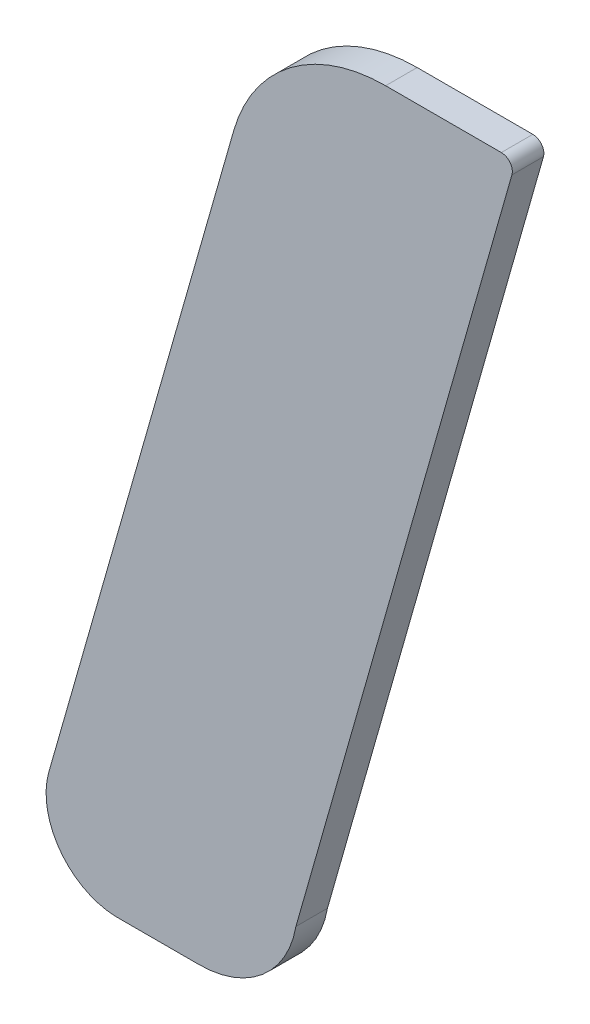
ISO-10303-21;
HEADER;
FILE_DESCRIPTION(('STEP AP214'),'2;1');
FILE_NAME('part.step','',(''),(''),'','','');
FILE_SCHEMA(('AUTOMOTIVE_DESIGN { 1 0 10303 214 1 1 1 1 }'));
ENDSEC;
DATA;
#1=APPLICATION_CONTEXT('core data for automotive mechanical design processes');
#2=APPLICATION_PROTOCOL_DEFINITION('international standard','automotive_design',2000,#1);
#3=PRODUCT_CONTEXT('',#1,'mechanical');
#4=PRODUCT('Part','Part','',(#3));
#5=PRODUCT_RELATED_PRODUCT_CATEGORY('part','',(#4));
#6=PRODUCT_DEFINITION_FORMATION('','',#4);
#7=PRODUCT_DEFINITION_CONTEXT('part definition',#1,'design');
#8=PRODUCT_DEFINITION('design','',#6,#7);
#9=PRODUCT_DEFINITION_SHAPE('','',#8);
#10=(LENGTH_UNIT() NAMED_UNIT(*) SI_UNIT(.MILLI.,.METRE.));
#11=(NAMED_UNIT(*) PLANE_ANGLE_UNIT() SI_UNIT($,.RADIAN.));
#12=(NAMED_UNIT(*) SI_UNIT($,.STERADIAN.) SOLID_ANGLE_UNIT());
#13=UNCERTAINTY_MEASURE_WITH_UNIT(LENGTH_MEASURE(1.E-05),#10,'distance_accuracy_value','');
#14=(GEOMETRIC_REPRESENTATION_CONTEXT(3) GLOBAL_UNCERTAINTY_ASSIGNED_CONTEXT((#13)) GLOBAL_UNIT_ASSIGNED_CONTEXT((#10,
#11,#12)) REPRESENTATION_CONTEXT('',''));
#15=CARTESIAN_POINT('',(0.,0.,0.));
#16=DIRECTION('',(0.,0.,1.));
#17=DIRECTION('',(1.,0.,0.));
#18=AXIS2_PLACEMENT_3D('',#15,#16,#17);
#19=CARTESIAN_POINT('',(6.39839035595241,12.2412260135686,4.75));
#20=DIRECTION('',(0.,0.,1.));
#21=DIRECTION('',(1.,0.,0.));
#22=AXIS2_PLACEMENT_3D('',#19,#20,#21);
#23=PLANE('',#22);
#24=CARTESIAN_POINT('',(6.39839035595241,12.2412260135686,4.75));
#25=DIRECTION('',(0.,0.,1.));
#26=DIRECTION('',(0.000110364229327659,0.999999993909868,0.));
#27=AXIS2_PLACEMENT_3D('',#24,#25,#26);
#28=CIRCLE('',#27,0.0100162142829728);
#29=CARTESIAN_POINT('',(6.39839146138418,12.2512422277906,4.75));
#30=VERTEX_POINT('',#29);
#31=CARTESIAN_POINT('',(6.38874467280177,12.2439251514161,4.75));
#32=VERTEX_POINT('',#31);
#33=EDGE_CURVE('E11',#30,#32,#28,.T.);
#34=ORIENTED_EDGE('',*,*,#33,.F.);
#35=DIRECTION('',(-0.999999993909869,0.000110364225029157,0.));
#36=VECTOR('',#35,1.);
#37=CARTESIAN_POINT('',(6.40573086305089,12.2512414177832,4.75));
#38=LINE('',#37,#36);
#39=CARTESIAN_POINT('',(6.40573086305089,12.2512414177832,4.75));
#40=VERTEX_POINT('',#39);
#41=EDGE_CURVE('E149',#40,#30,#38,.T.);
#42=ORIENTED_EDGE('',*,*,#41,.F.);
#43=CARTESIAN_POINT('',(6.40573078579593,12.2505414177875,4.75));
#44=DIRECTION('',(0.,0.,1.));
#45=DIRECTION('',(0.961802592410473,-0.273743992139541,0.));
#46=AXIS2_PLACEMENT_3D('',#43,#44,#45);
#47=CIRCLE('',#46,0.000700000000000006);
#48=CARTESIAN_POINT('',(6.40640404761063,12.250349796993,4.75));
#49=VERTEX_POINT('',#48);
#50=EDGE_CURVE('E142',#49,#40,#47,.T.);
#51=ORIENTED_EDGE('',*,*,#50,.F.);
#52=DIRECTION('',(0.27374399211542,0.961802592417339,0.));
#53=VECTOR('',#52,1.);
#54=CARTESIAN_POINT('',(6.39269996335301,12.2022003429581,4.75));
#55=LINE('',#54,#53);
#56=CARTESIAN_POINT('',(6.39269996335301,12.2022003429581,4.75));
#57=VERTEX_POINT('',#56);
#58=EDGE_CURVE('E133',#57,#49,#55,.T.);
#59=ORIENTED_EDGE('',*,*,#58,.F.);
#60=CARTESIAN_POINT('',(6.38655212023019,12.2032736076721,4.75));
#61=DIRECTION('',(0.,0.,1.));
#62=DIRECTION('',(-4.8387954728348E-12,-1.,0.));
#63=AXIS2_PLACEMENT_3D('',#60,#61,#62);
#64=CIRCLE('',#63,0.00624082303939911);
#65=CARTESIAN_POINT('',(6.38655212023016,12.1970327846327,4.75));
#66=VERTEX_POINT('',#65);
#67=EDGE_CURVE('E124',#66,#57,#64,.T.);
#68=ORIENTED_EDGE('',*,*,#67,.F.);
#69=DIRECTION('',(1.,0.,0.));
#70=VECTOR('',#69,1.);
#71=CARTESIAN_POINT('',(6.38123695292394,12.1970327846327,4.75));
#72=LINE('',#71,#70);
#73=CARTESIAN_POINT('',(6.38123695292394,12.1970327846327,4.75));
#74=VERTEX_POINT('',#73);
#75=EDGE_CURVE('E115',#74,#66,#72,.T.);
#76=ORIENTED_EDGE('',*,*,#75,.F.);
#77=CARTESIAN_POINT('',(6.38142021312683,12.2016002499329,4.75));
#78=DIRECTION('',(0.,0.,1.));
#79=DIRECTION('',(-0.961612413234288,0.274411309376509,0.));
#80=AXIS2_PLACEMENT_3D('',#77,#78,#79);
#81=CIRCLE('',#80,0.00457114029211092);
#82=CARTESIAN_POINT('',(6.37702454787931,12.2028546225258,4.75));
#83=VERTEX_POINT('',#82);
#84=EDGE_CURVE('E106',#83,#74,#81,.T.);
#85=ORIENTED_EDGE('',*,*,#84,.F.);
#86=DIRECTION('',(-0.274411309388016,-0.961612413231004,0.));
#87=VECTOR('',#86,1.);
#88=CARTESIAN_POINT('',(6.38874467280177,12.2439251514161,4.75));
#89=LINE('',#88,#87);
#90=EDGE_CURVE('E86',#32,#83,#89,.T.);
#91=ORIENTED_EDGE('',*,*,#90,.F.);
#92=EDGE_LOOP('',(#34,#42,#51,#59,#68,#76,#85,#91));
#93=FACE_BOUND('',#92,.T.);
#94=ADVANCED_FACE('F17',(#93),#23,.F.);
#95=CARTESIAN_POINT('',(6.40573086305089,12.2512414177832,4.83252449867128));
#96=DIRECTION('',(-0.000110364225009692,-0.999999993909869,0.));
#97=DIRECTION('',(0.999999993909869,-0.000110364225009692,0.));
#98=AXIS2_PLACEMENT_3D('',#95,#96,#97);
#99=PLANE('',#98);
#100=DIRECTION('',(0.,0.,-1.));
#101=VECTOR('',#100,1.);
#102=CARTESIAN_POINT('',(6.39839146138418,12.2512422277906,4.752));
#103=LINE('',#102,#101);
#104=CARTESIAN_POINT('',(6.39839146138418,12.2512422277906,4.752));
#105=VERTEX_POINT('',#104);
#106=EDGE_CURVE('E24',#105,#30,#103,.T.);
#107=ORIENTED_EDGE('',*,*,#106,.F.);
#108=DIRECTION('',(0.999999993909869,-0.000110364224787127,0.));
#109=VECTOR('',#108,1.);
#110=CARTESIAN_POINT('',(6.39839146138418,12.2512422277906,4.752));
#111=LINE('',#110,#109);
#112=CARTESIAN_POINT('',(6.40573086305089,12.2512414177832,4.752));
#113=VERTEX_POINT('',#112);
#114=EDGE_CURVE('E99',#105,#113,#111,.T.);
#115=ORIENTED_EDGE('',*,*,#114,.T.);
#116=DIRECTION('',(-4.44089209849914E-13,0.,-1.));
#117=VECTOR('',#116,1.);
#118=CARTESIAN_POINT('',(6.40573086305089,12.2512414177832,4.752));
#119=LINE('',#118,#117);
#120=EDGE_CURVE('E146',#113,#40,#119,.T.);
#121=ORIENTED_EDGE('',*,*,#120,.T.);
#122=ORIENTED_EDGE('',*,*,#41,.T.);
#123=EDGE_LOOP('',(#107,#115,#121,#122));
#124=FACE_BOUND('',#123,.T.);
#125=ADVANCED_FACE('F150',(#124),#99,.F.);
#126=CARTESIAN_POINT('',(6.40573078579593,12.2505414177875,4.83252449867128));
#127=DIRECTION('',(0.,0.,-1.));
#128=DIRECTION('',(0.79807585449164,0.602556993551181,0.));
#129=AXIS2_PLACEMENT_3D('',#126,#127,#128);
#130=CYLINDRICAL_SURFACE('',#129,0.000700000000000006);
#131=ORIENTED_EDGE('',*,*,#120,.F.);
#132=CARTESIAN_POINT('',(6.40573078579593,12.2505414177875,4.752));
#133=DIRECTION('',(0.,0.,-1.));
#134=DIRECTION('',(0.000110364228232489,0.999999993909868,0.));
#135=AXIS2_PLACEMENT_3D('',#132,#133,#134);
#136=CIRCLE('',#135,0.000700000000000006);
#137=CARTESIAN_POINT('',(6.40640404761063,12.250349796993,4.752));
#138=VERTEX_POINT('',#137);
#139=EDGE_CURVE('E136',#113,#138,#136,.T.);
#140=ORIENTED_EDGE('',*,*,#139,.T.);
#141=DIRECTION('',(0.,8.88178419699829E-13,-1.));
#142=VECTOR('',#141,1.);
#143=CARTESIAN_POINT('',(6.40640404761063,12.250349796993,4.752));
#144=LINE('',#143,#142);
#145=EDGE_CURVE('E139',#138,#49,#144,.T.);
#146=ORIENTED_EDGE('',*,*,#145,.T.);
#147=ORIENTED_EDGE('',*,*,#50,.T.);
#148=EDGE_LOOP('',(#131,#140,#146,#147));
#149=FACE_BOUND('',#148,.T.);
#150=ADVANCED_FACE('F152',(#149),#130,.T.);
#151=CARTESIAN_POINT('',(6.39269996335301,12.2022003429581,4.83252449867128));
#152=DIRECTION('',(-0.961802592417339,0.273743992115419,0.));
#153=DIRECTION('',(-0.273743992115419,-0.961802592417339,0.));
#154=AXIS2_PLACEMENT_3D('',#151,#152,#153);
#155=PLANE('',#154);
#156=ORIENTED_EDGE('',*,*,#145,.F.);
#157=DIRECTION('',(-0.27374399211542,-0.961802592417339,0.));
#158=VECTOR('',#157,1.);
#159=CARTESIAN_POINT('',(6.40640404761064,12.250349796993,4.752));
#160=LINE('',#159,#158);
#161=CARTESIAN_POINT('',(6.39269996335301,12.2022003429581,4.752));
#162=VERTEX_POINT('',#161);
#163=EDGE_CURVE('E127',#138,#162,#160,.T.);
#164=ORIENTED_EDGE('',*,*,#163,.T.);
#165=DIRECTION('',(4.44089209849914E-13,8.88178419699829E-13,-1.));
#166=VECTOR('',#165,1.);
#167=CARTESIAN_POINT('',(6.39269996335301,12.2022003429581,4.752));
#168=LINE('',#167,#166);
#169=EDGE_CURVE('E130',#162,#57,#168,.T.);
#170=ORIENTED_EDGE('',*,*,#169,.T.);
#171=ORIENTED_EDGE('',*,*,#58,.T.);
#172=EDGE_LOOP('',(#156,#164,#170,#171));
#173=FACE_BOUND('',#172,.T.);
#174=ADVANCED_FACE('F155',(#173),#155,.F.);
#175=CARTESIAN_POINT('',(6.38655212023019,12.2032736076721,4.83252449867128));
#176=DIRECTION('',(0.,0.,-1.));
#177=DIRECTION('',(-1.,0.,0.));
#178=AXIS2_PLACEMENT_3D('',#175,#176,#177);
#179=CYLINDRICAL_SURFACE('',#178,0.00624082303939911);
#180=ORIENTED_EDGE('',*,*,#169,.F.);
#181=CARTESIAN_POINT('',(6.38655212023019,12.2032736076721,4.752));
#182=DIRECTION('',(0.,0.,-1.));
#183=DIRECTION('',(0.985101337436687,-0.171974867293017,0.));
#184=AXIS2_PLACEMENT_3D('',#181,#182,#183);
#185=CIRCLE('',#184,0.00624082303939911);
#186=CARTESIAN_POINT('',(6.38655212023016,12.1970327846327,4.752));
#187=VERTEX_POINT('',#186);
#188=EDGE_CURVE('E118',#162,#187,#185,.T.);
#189=ORIENTED_EDGE('',*,*,#188,.T.);
#190=DIRECTION('',(0.,0.,-1.));
#191=VECTOR('',#190,1.);
#192=CARTESIAN_POINT('',(6.38655212023016,12.1970327846327,4.752));
#193=LINE('',#192,#191);
#194=EDGE_CURVE('E121',#187,#66,#193,.T.);
#195=ORIENTED_EDGE('',*,*,#194,.T.);
#196=ORIENTED_EDGE('',*,*,#67,.T.);
#197=EDGE_LOOP('',(#180,#189,#195,#196));
#198=FACE_BOUND('',#197,.T.);
#199=ADVANCED_FACE('F158',(#198),#179,.T.);
#200=CARTESIAN_POINT('',(6.38123695292394,12.1970327846327,4.83252449867128));
#201=DIRECTION('',(0.,1.,0.));
#202=DIRECTION('',(0.,0.,1.));
#203=AXIS2_PLACEMENT_3D('',#200,#201,#202);
#204=PLANE('',#203);
#205=ORIENTED_EDGE('',*,*,#194,.F.);
#206=DIRECTION('',(-1.,0.,0.));
#207=VECTOR('',#206,1.);
#208=CARTESIAN_POINT('',(6.38655212023016,12.1970327846327,4.752));
#209=LINE('',#208,#207);
#210=CARTESIAN_POINT('',(6.38123695292394,12.1970327846327,4.752));
#211=VERTEX_POINT('',#210);
#212=EDGE_CURVE('E109',#187,#211,#209,.T.);
#213=ORIENTED_EDGE('',*,*,#212,.T.);
#214=DIRECTION('',(0.,0.,-1.));
#215=VECTOR('',#214,1.);
#216=CARTESIAN_POINT('',(6.38123695292394,12.1970327846327,4.752));
#217=LINE('',#216,#215);
#218=EDGE_CURVE('E112',#211,#74,#217,.T.);
#219=ORIENTED_EDGE('',*,*,#218,.T.);
#220=ORIENTED_EDGE('',*,*,#75,.T.);
#221=EDGE_LOOP('',(#205,#213,#219,#220));
#222=FACE_BOUND('',#221,.T.);
#223=ADVANCED_FACE('F160',(#222),#204,.F.);
#224=CARTESIAN_POINT('',(6.38142021312683,12.2016002499329,4.83252449867128));
#225=DIRECTION('',(0.,0.,-1.));
#226=DIRECTION('',(-1.,0.,0.));
#227=AXIS2_PLACEMENT_3D('',#224,#225,#226);
#228=CYLINDRICAL_SURFACE('',#227,0.00457114029211092);
#229=ORIENTED_EDGE('',*,*,#218,.F.);
#230=CARTESIAN_POINT('',(6.38142021312683,12.2016002499329,4.752));
#231=DIRECTION('',(0.,0.,-1.));
#232=DIRECTION('',(-0.0400906975453594,-0.999196044813192,0.));
#233=AXIS2_PLACEMENT_3D('',#230,#231,#232);
#234=CIRCLE('',#233,0.00457114029211092);
#235=CARTESIAN_POINT('',(6.37702454787931,12.2028546225258,4.752));
#236=VERTEX_POINT('',#235);
#237=EDGE_CURVE('E103',#211,#236,#234,.T.);
#238=ORIENTED_EDGE('',*,*,#237,.T.);
#239=DIRECTION('',(0.,-8.88178419699829E-13,-1.));
#240=VECTOR('',#239,1.);
#241=CARTESIAN_POINT('',(6.37702454787931,12.2028546225258,4.752));
#242=LINE('',#241,#240);
#243=EDGE_CURVE('E92',#236,#83,#242,.T.);
#244=ORIENTED_EDGE('',*,*,#243,.T.);
#245=ORIENTED_EDGE('',*,*,#84,.T.);
#246=EDGE_LOOP('',(#229,#238,#244,#245));
#247=FACE_BOUND('',#246,.T.);
#248=ADVANCED_FACE('F163',(#247),#228,.T.);
#249=CARTESIAN_POINT('',(6.38874467280177,12.2439251514161,4.83252449867128));
#250=DIRECTION('',(0.961612413231003,-0.27441130938802,0.));
#251=DIRECTION('',(0.27441130938802,0.961612413231003,0.));
#252=AXIS2_PLACEMENT_3D('',#249,#250,#251);
#253=PLANE('',#252);
#254=ORIENTED_EDGE('',*,*,#243,.F.);
#255=DIRECTION('',(0.274411309388008,0.961612413231006,0.));
#256=VECTOR('',#255,1.);
#257=CARTESIAN_POINT('',(6.37702454787932,12.2028546225258,4.752));
#258=LINE('',#257,#256);
#259=CARTESIAN_POINT('',(6.38874467280177,12.2439251514161,4.752));
#260=VERTEX_POINT('',#259);
#261=EDGE_CURVE('E87',#236,#260,#258,.T.);
#262=ORIENTED_EDGE('',*,*,#261,.T.);
#263=DIRECTION('',(0.,0.,-1.));
#264=VECTOR('',#263,1.);
#265=CARTESIAN_POINT('',(6.38874467280177,12.2439251514161,4.752));
#266=LINE('',#265,#264);
#267=EDGE_CURVE('E78',#260,#32,#266,.T.);
#268=ORIENTED_EDGE('',*,*,#267,.T.);
#269=ORIENTED_EDGE('',*,*,#90,.T.);
#270=EDGE_LOOP('',(#254,#262,#268,#269));
#271=FACE_BOUND('',#270,.T.);
#272=ADVANCED_FACE('F90',(#271),#253,.F.);
#273=CARTESIAN_POINT('',(6.39839035595241,12.2412260135686,4.83252449867128));
#274=DIRECTION('',(0.,0.,-1.));
#275=DIRECTION('',(-1.,0.,0.));
#276=AXIS2_PLACEMENT_3D('',#273,#274,#275);
#277=CYLINDRICAL_SURFACE('',#276,0.0100162142829728);
#278=ORIENTED_EDGE('',*,*,#267,.F.);
#279=CARTESIAN_POINT('',(6.39839035595241,12.2412260135686,4.752));
#280=DIRECTION('',(0.,0.,-1.));
#281=DIRECTION('',(-0.963006868477337,0.269476847364433,0.));
#282=AXIS2_PLACEMENT_3D('',#279,#280,#281);
#283=CIRCLE('',#282,0.0100162142829728);
#284=EDGE_CURVE('E82',#260,#105,#283,.T.);
#285=ORIENTED_EDGE('',*,*,#284,.T.);
#286=ORIENTED_EDGE('',*,*,#106,.T.);
#287=ORIENTED_EDGE('',*,*,#33,.T.);
#288=EDGE_LOOP('',(#278,#285,#286,#287));
#289=FACE_BOUND('',#288,.T.);
#290=ADVANCED_FACE('F80',(#289),#277,.T.);
#291=CARTESIAN_POINT('',(5.86959286961936,12.1314924009898,4.752));
#292=DIRECTION('',(0.,0.,-1.));
#293=DIRECTION('',(-1.,0.,0.));
#294=AXIS2_PLACEMENT_3D('',#291,#292,#293);
#295=PLANE('',#294);
#296=ORIENTED_EDGE('',*,*,#261,.F.);
#297=ORIENTED_EDGE('',*,*,#237,.F.);
#298=ORIENTED_EDGE('',*,*,#212,.F.);
#299=ORIENTED_EDGE('',*,*,#188,.F.);
#300=ORIENTED_EDGE('',*,*,#163,.F.);
#301=ORIENTED_EDGE('',*,*,#139,.F.);
#302=ORIENTED_EDGE('',*,*,#114,.F.);
#303=ORIENTED_EDGE('',*,*,#284,.F.);
#304=EDGE_LOOP('',(#296,#297,#298,#299,#300,#301,#302,#303));
#305=FACE_BOUND('',#304,.T.);
#306=ADVANCED_FACE('F97',(#305),#295,.F.);
#307=CLOSED_SHELL('',(#94,#125,#150,#174,#199,#223,#248,#272,#290,#306));
#308=MANIFOLD_SOLID_BREP('B1',#307);
#309=ADVANCED_BREP_SHAPE_REPRESENTATION('',(#18,#308),#14);
#310=SHAPE_DEFINITION_REPRESENTATION(#9,#309);
ENDSEC;
END-ISO-10303-21;
